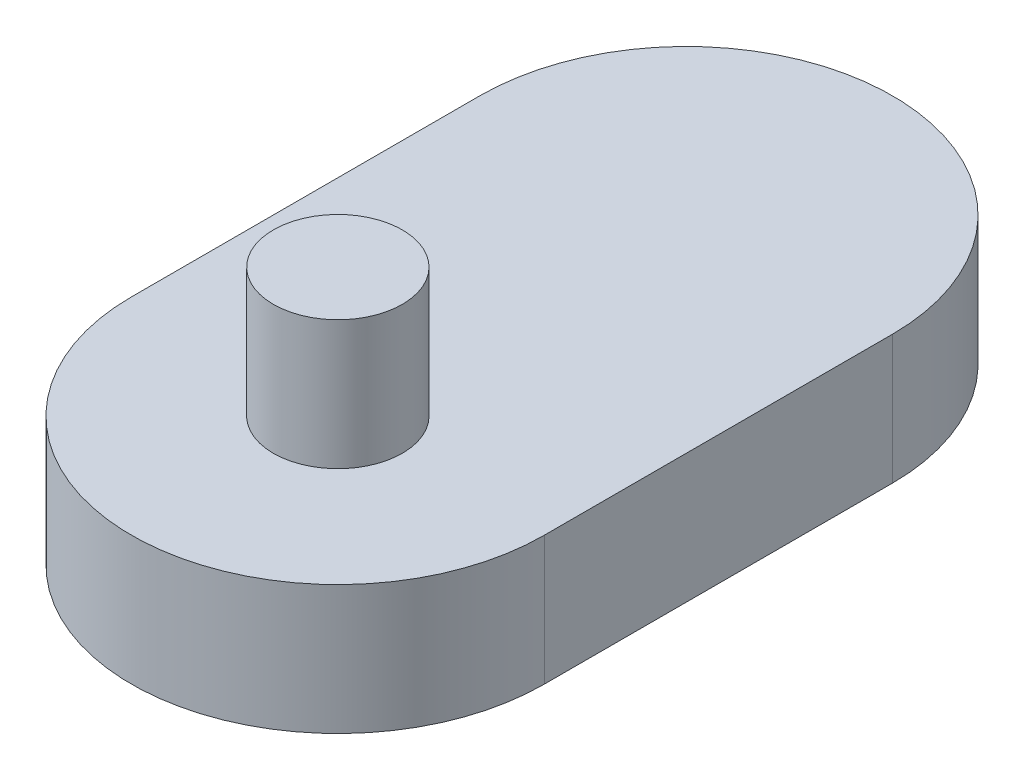
ISO-10303-21;
HEADER;
FILE_DESCRIPTION(('STEP AP214'),'2;1');
FILE_NAME('part.step','',(''),(''),'','','');
FILE_SCHEMA(('AUTOMOTIVE_DESIGN { 1 0 10303 214 1 1 1 1 }'));
ENDSEC;
DATA;
#1=APPLICATION_CONTEXT('core data for automotive mechanical design processes');
#2=APPLICATION_PROTOCOL_DEFINITION('international standard','automotive_design',2000,#1);
#3=PRODUCT_CONTEXT('',#1,'mechanical');
#4=PRODUCT('Part','Part','',(#3));
#5=PRODUCT_RELATED_PRODUCT_CATEGORY('part','',(#4));
#6=PRODUCT_DEFINITION_FORMATION('','',#4);
#7=PRODUCT_DEFINITION_CONTEXT('part definition',#1,'design');
#8=PRODUCT_DEFINITION('design','',#6,#7);
#9=PRODUCT_DEFINITION_SHAPE('','',#8);
#10=(LENGTH_UNIT() NAMED_UNIT(*) SI_UNIT(.MILLI.,.METRE.));
#11=(NAMED_UNIT(*) PLANE_ANGLE_UNIT() SI_UNIT($,.RADIAN.));
#12=(NAMED_UNIT(*) SI_UNIT($,.STERADIAN.) SOLID_ANGLE_UNIT());
#13=UNCERTAINTY_MEASURE_WITH_UNIT(LENGTH_MEASURE(1.E-05),#10,'distance_accuracy_value','');
#14=(GEOMETRIC_REPRESENTATION_CONTEXT(3) GLOBAL_UNCERTAINTY_ASSIGNED_CONTEXT((#13)) GLOBAL_UNIT_ASSIGNED_CONTEXT((#10,
#11,#12)) REPRESENTATION_CONTEXT('',''));
#15=CARTESIAN_POINT('',(0.,0.,0.));
#16=DIRECTION('',(0.,0.,1.));
#17=DIRECTION('',(1.,0.,0.));
#18=AXIS2_PLACEMENT_3D('',#15,#16,#17);
#19=CARTESIAN_POINT('',(0.,2.5,-6.75));
#20=DIRECTION('',(0.,-1.,0.));
#21=DIRECTION('',(0.,0.,-1.));
#22=AXIS2_PLACEMENT_3D('',#19,#20,#21);
#23=CYLINDRICAL_SURFACE('',#22,4.);
#24=CARTESIAN_POINT('',(0.,0.,-6.75));
#25=DIRECTION('',(0.,1.,0.));
#26=DIRECTION('',(0.,0.,1.));
#27=AXIS2_PLACEMENT_3D('',#24,#25,#26);
#28=CIRCLE('',#27,4.);
#29=CARTESIAN_POINT('',(4.,0.,-6.75));
#30=VERTEX_POINT('',#29);
#31=CARTESIAN_POINT('',(-4.,0.,-6.75));
#32=VERTEX_POINT('',#31);
#33=EDGE_CURVE('E99',#30,#32,#28,.T.);
#34=ORIENTED_EDGE('',*,*,#33,.T.);
#35=DIRECTION('',(0.,-1.,0.));
#36=VECTOR('',#35,1.);
#37=CARTESIAN_POINT('',(-4.,2.5,-6.75));
#38=LINE('',#37,#36);
#39=CARTESIAN_POINT('',(-4.,2.5,-6.75));
#40=VERTEX_POINT('',#39);
#41=EDGE_CURVE('E41',#40,#32,#38,.T.);
#42=ORIENTED_EDGE('',*,*,#41,.F.);
#43=CARTESIAN_POINT('',(0.,2.5,-6.75));
#44=DIRECTION('',(0.,1.,0.));
#45=DIRECTION('',(0.,0.,1.));
#46=AXIS2_PLACEMENT_3D('',#43,#44,#45);
#47=CIRCLE('',#46,4.);
#48=CARTESIAN_POINT('',(4.,2.5,-6.75));
#49=VERTEX_POINT('',#48);
#50=EDGE_CURVE('E83',#49,#40,#47,.T.);
#51=ORIENTED_EDGE('',*,*,#50,.F.);
#52=DIRECTION('',(0.,-1.,0.));
#53=VECTOR('',#52,1.);
#54=CARTESIAN_POINT('',(4.,2.5,-6.75));
#55=LINE('',#54,#53);
#56=EDGE_CURVE('E49',#49,#30,#55,.T.);
#57=ORIENTED_EDGE('',*,*,#56,.T.);
#58=EDGE_LOOP('',(#34,#42,#51,#57));
#59=FACE_BOUND('',#58,.T.);
#60=ADVANCED_FACE('F33',(#59),#23,.T.);
#61=CARTESIAN_POINT('',(-4.,2.5,-6.75));
#62=DIRECTION('',(1.,0.,0.));
#63=DIRECTION('',(0.,0.,-1.));
#64=AXIS2_PLACEMENT_3D('',#61,#62,#63);
#65=PLANE('',#64);
#66=DIRECTION('',(0.,0.,1.));
#67=VECTOR('',#66,1.);
#68=CARTESIAN_POINT('',(-4.,0.,-6.75));
#69=LINE('',#68,#67);
#70=CARTESIAN_POINT('',(-4.,0.,0.));
#71=VERTEX_POINT('',#70);
#72=EDGE_CURVE('E89',#32,#71,#69,.T.);
#73=ORIENTED_EDGE('',*,*,#72,.T.);
#74=DIRECTION('',(0.,-1.,0.));
#75=VECTOR('',#74,1.);
#76=CARTESIAN_POINT('',(-4.,2.5,0.));
#77=LINE('',#76,#75);
#78=CARTESIAN_POINT('',(-4.,2.5,0.));
#79=VERTEX_POINT('',#78);
#80=EDGE_CURVE('E87',#79,#71,#77,.T.);
#81=ORIENTED_EDGE('',*,*,#80,.F.);
#82=DIRECTION('',(0.,0.,1.));
#83=VECTOR('',#82,1.);
#84=CARTESIAN_POINT('',(-4.,2.5,-6.75));
#85=LINE('',#84,#83);
#86=EDGE_CURVE('E76',#40,#79,#85,.T.);
#87=ORIENTED_EDGE('',*,*,#86,.F.);
#88=ORIENTED_EDGE('',*,*,#41,.T.);
#89=EDGE_LOOP('',(#73,#81,#87,#88));
#90=FACE_BOUND('',#89,.T.);
#91=ADVANCED_FACE('F88',(#90),#65,.F.);
#92=CARTESIAN_POINT('',(0.,2.5,0.));
#93=DIRECTION('',(0.,-1.,0.));
#94=DIRECTION('',(0.,0.,-1.));
#95=AXIS2_PLACEMENT_3D('',#92,#93,#94);
#96=CYLINDRICAL_SURFACE('',#95,4.);
#97=CARTESIAN_POINT('',(0.,0.,0.));
#98=DIRECTION('',(0.,1.,0.));
#99=DIRECTION('',(0.,0.,1.));
#100=AXIS2_PLACEMENT_3D('',#97,#98,#99);
#101=CIRCLE('',#100,4.);
#102=CARTESIAN_POINT('',(4.,0.,0.));
#103=VERTEX_POINT('',#102);
#104=EDGE_CURVE('E103',#71,#103,#101,.T.);
#105=ORIENTED_EDGE('',*,*,#104,.T.);
#106=DIRECTION('',(0.,-1.,0.));
#107=VECTOR('',#106,1.);
#108=CARTESIAN_POINT('',(4.,2.5,0.));
#109=LINE('',#108,#107);
#110=CARTESIAN_POINT('',(4.,2.5,0.));
#111=VERTEX_POINT('',#110);
#112=EDGE_CURVE('E64',#111,#103,#109,.T.);
#113=ORIENTED_EDGE('',*,*,#112,.F.);
#114=CARTESIAN_POINT('',(0.,2.5,0.));
#115=DIRECTION('',(0.,1.,0.));
#116=DIRECTION('',(0.,0.,1.));
#117=AXIS2_PLACEMENT_3D('',#114,#115,#116);
#118=CIRCLE('',#117,4.);
#119=EDGE_CURVE('E82',#79,#111,#118,.T.);
#120=ORIENTED_EDGE('',*,*,#119,.F.);
#121=ORIENTED_EDGE('',*,*,#80,.T.);
#122=EDGE_LOOP('',(#105,#113,#120,#121));
#123=FACE_BOUND('',#122,.T.);
#124=ADVANCED_FACE('F93',(#123),#96,.T.);
#125=CARTESIAN_POINT('',(4.,2.5,-6.75));
#126=DIRECTION('',(1.,0.,0.));
#127=DIRECTION('',(0.,0.,-1.));
#128=AXIS2_PLACEMENT_3D('',#125,#126,#127);
#129=PLANE('',#128);
#130=DIRECTION('',(0.,0.,1.));
#131=VECTOR('',#130,1.);
#132=CARTESIAN_POINT('',(4.,0.,-6.75));
#133=LINE('',#132,#131);
#134=EDGE_CURVE('E105',#30,#103,#133,.T.);
#135=ORIENTED_EDGE('',*,*,#134,.F.);
#136=ORIENTED_EDGE('',*,*,#56,.F.);
#137=DIRECTION('',(0.,0.,1.));
#138=VECTOR('',#137,1.);
#139=CARTESIAN_POINT('',(4.,2.5,-6.75));
#140=LINE('',#139,#138);
#141=EDGE_CURVE('E94',#49,#111,#140,.T.);
#142=ORIENTED_EDGE('',*,*,#141,.T.);
#143=ORIENTED_EDGE('',*,*,#112,.T.);
#144=EDGE_LOOP('',(#135,#136,#142,#143));
#145=FACE_BOUND('',#144,.T.);
#146=ADVANCED_FACE('F111',(#145),#129,.T.);
#147=CARTESIAN_POINT('',(0.,2.5,-6.75));
#148=DIRECTION('',(0.,1.,0.));
#149=DIRECTION('',(0.,0.,1.));
#150=AXIS2_PLACEMENT_3D('',#147,#148,#149);
#151=PLANE('',#150);
#152=CARTESIAN_POINT('',(0.,2.5,0.));
#153=DIRECTION('',(0.,1.,0.));
#154=DIRECTION('',(0.,0.,1.));
#155=AXIS2_PLACEMENT_3D('',#152,#153,#154);
#156=CIRCLE('',#155,1.25);
#157=CARTESIAN_POINT('',(0.,2.5,1.25));
#158=VERTEX_POINT('',#157);
#159=EDGE_CURVE('E197',#158,#158,#156,.T.);
#160=ORIENTED_EDGE('',*,*,#159,.F.);
#161=EDGE_LOOP('',(#160));
#162=FACE_BOUND('',#161,.T.);
#163=ORIENTED_EDGE('',*,*,#50,.T.);
#164=ORIENTED_EDGE('',*,*,#86,.T.);
#165=ORIENTED_EDGE('',*,*,#119,.T.);
#166=ORIENTED_EDGE('',*,*,#141,.F.);
#167=EDGE_LOOP('',(#163,#164,#165,#166));
#168=FACE_BOUND('',#167,.T.);
#169=ADVANCED_FACE('F79',(#162,#168),#151,.T.);
#170=CARTESIAN_POINT('',(0.,0.,-6.75));
#171=DIRECTION('',(0.,1.,0.));
#172=DIRECTION('',(0.,0.,1.));
#173=AXIS2_PLACEMENT_3D('',#170,#171,#172);
#174=PLANE('',#173);
#175=CARTESIAN_POINT('',(0.,0.,-6.75));
#176=DIRECTION('',(0.,1.,0.));
#177=DIRECTION('',(0.,0.,1.));
#178=AXIS2_PLACEMENT_3D('',#175,#176,#177);
#179=CIRCLE('',#178,1.25);
#180=CARTESIAN_POINT('',(0.,0.,-5.5));
#181=VERTEX_POINT('',#180);
#182=EDGE_CURVE('E11',#181,#181,#179,.F.);
#183=ORIENTED_EDGE('',*,*,#182,.F.);
#184=EDGE_LOOP('',(#183));
#185=FACE_BOUND('',#184,.T.);
#186=ORIENTED_EDGE('',*,*,#33,.F.);
#187=ORIENTED_EDGE('',*,*,#134,.T.);
#188=ORIENTED_EDGE('',*,*,#104,.F.);
#189=ORIENTED_EDGE('',*,*,#72,.F.);
#190=EDGE_LOOP('',(#186,#187,#188,#189));
#191=FACE_BOUND('',#190,.T.);
#192=ADVANCED_FACE('F110',(#185,#191),#174,.F.);
#193=CARTESIAN_POINT('',(0.,5.,0.));
#194=DIRECTION('',(0.,-1.,0.));
#195=DIRECTION('',(0.,0.,-1.));
#196=AXIS2_PLACEMENT_3D('',#193,#194,#195);
#197=CYLINDRICAL_SURFACE('',#196,1.25);
#198=CARTESIAN_POINT('',(0.,5.,0.));
#199=DIRECTION('',(0.,1.,0.));
#200=DIRECTION('',(0.,0.,1.));
#201=AXIS2_PLACEMENT_3D('',#198,#199,#200);
#202=CIRCLE('',#201,1.25);
#203=CARTESIAN_POINT('',(0.,5.,1.25));
#204=VERTEX_POINT('',#203);
#205=EDGE_CURVE('E101',#204,#204,#202,.T.);
#206=ORIENTED_EDGE('',*,*,#205,.F.);
#207=EDGE_LOOP('',(#206));
#208=FACE_BOUND('',#207,.T.);
#209=ORIENTED_EDGE('',*,*,#159,.T.);
#210=EDGE_LOOP('',(#209));
#211=FACE_BOUND('',#210,.T.);
#212=ADVANCED_FACE('F149',(#208,#211),#197,.T.);
#213=CARTESIAN_POINT('',(0.,5.,0.));
#214=DIRECTION('',(0.,1.,0.));
#215=DIRECTION('',(0.,0.,1.));
#216=AXIS2_PLACEMENT_3D('',#213,#214,#215);
#217=PLANE('',#216);
#218=ORIENTED_EDGE('',*,*,#205,.T.);
#219=EDGE_LOOP('',(#218));
#220=FACE_BOUND('',#219,.T.);
#221=ADVANCED_FACE('F154',(#220),#217,.T.);
#222=CARTESIAN_POINT('',(0.,-2.5,-6.75));
#223=DIRECTION('',(0.,1.,0.));
#224=DIRECTION('',(0.,0.,1.));
#225=AXIS2_PLACEMENT_3D('',#222,#223,#224);
#226=CYLINDRICAL_SURFACE('',#225,1.25);
#227=CARTESIAN_POINT('',(0.,-2.5,-6.75));
#228=DIRECTION('',(0.,-1.,0.));
#229=DIRECTION('',(0.,0.,-1.));
#230=AXIS2_PLACEMENT_3D('',#227,#228,#229);
#231=CIRCLE('',#230,1.25);
#232=CARTESIAN_POINT('',(0.,-2.5,-8.));
#233=VERTEX_POINT('',#232);
#234=EDGE_CURVE('E196',#233,#233,#231,.T.);
#235=ORIENTED_EDGE('',*,*,#234,.F.);
#236=EDGE_LOOP('',(#235));
#237=FACE_BOUND('',#236,.T.);
#238=ORIENTED_EDGE('',*,*,#182,.T.);
#239=EDGE_LOOP('',(#238));
#240=FACE_BOUND('',#239,.T.);
#241=ADVANCED_FACE('F164',(#237,#240),#226,.T.);
#242=CARTESIAN_POINT('',(0.,-2.5,-6.75));
#243=DIRECTION('',(0.,-1.,0.));
#244=DIRECTION('',(0.,0.,-1.));
#245=AXIS2_PLACEMENT_3D('',#242,#243,#244);
#246=PLANE('',#245);
#247=ORIENTED_EDGE('',*,*,#234,.T.);
#248=EDGE_LOOP('',(#247));
#249=FACE_BOUND('',#248,.T.);
#250=ADVANCED_FACE('F180',(#249),#246,.T.);
#251=CLOSED_SHELL('',(#60,#91,#124,#146,#169,#192,#212,#221,#241,#250));
#252=MANIFOLD_SOLID_BREP('B2',#251);
#253=ADVANCED_BREP_SHAPE_REPRESENTATION('',(#18,#252),#14);
#254=SHAPE_DEFINITION_REPRESENTATION(#9,#253);
ENDSEC;
END-ISO-10303-21;
